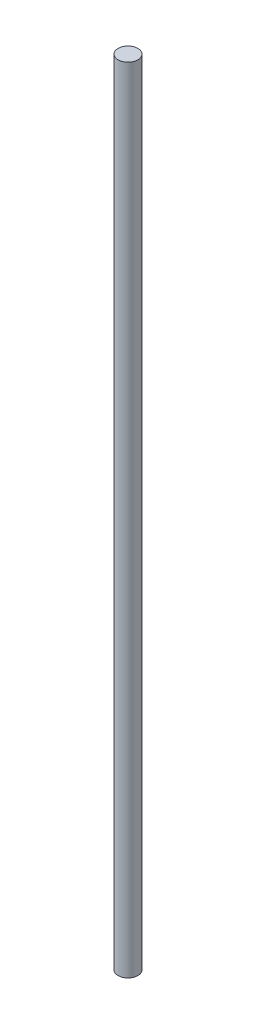
ISO-10303-21;
HEADER;
FILE_DESCRIPTION(('STEP AP214'),'2;1');
FILE_NAME('part.step','',(''),(''),'','','');
FILE_SCHEMA(('AUTOMOTIVE_DESIGN { 1 0 10303 214 1 1 1 1 }'));
ENDSEC;
DATA;
#1=APPLICATION_CONTEXT('core data for automotive mechanical design processes');
#2=APPLICATION_PROTOCOL_DEFINITION('international standard','automotive_design',2000,#1);
#3=PRODUCT_CONTEXT('',#1,'mechanical');
#4=PRODUCT('Part','Part','',(#3));
#5=PRODUCT_RELATED_PRODUCT_CATEGORY('part','',(#4));
#6=PRODUCT_DEFINITION_FORMATION('','',#4);
#7=PRODUCT_DEFINITION_CONTEXT('part definition',#1,'design');
#8=PRODUCT_DEFINITION('design','',#6,#7);
#9=PRODUCT_DEFINITION_SHAPE('','',#8);
#10=(LENGTH_UNIT() NAMED_UNIT(*) SI_UNIT(.MILLI.,.METRE.));
#11=(NAMED_UNIT(*) PLANE_ANGLE_UNIT() SI_UNIT($,.RADIAN.));
#12=(NAMED_UNIT(*) SI_UNIT($,.STERADIAN.) SOLID_ANGLE_UNIT());
#13=UNCERTAINTY_MEASURE_WITH_UNIT(LENGTH_MEASURE(1.E-05),#10,'distance_accuracy_value','');
#14=(GEOMETRIC_REPRESENTATION_CONTEXT(3) GLOBAL_UNCERTAINTY_ASSIGNED_CONTEXT((#13)) GLOBAL_UNIT_ASSIGNED_CONTEXT((#10,
#11,#12)) REPRESENTATION_CONTEXT('',''));
#15=CARTESIAN_POINT('',(0.,0.,0.));
#16=DIRECTION('',(0.,0.,1.));
#17=DIRECTION('',(1.,0.,0.));
#18=AXIS2_PLACEMENT_3D('',#15,#16,#17);
#19=CARTESIAN_POINT('',(0.,127.,0.));
#20=DIRECTION('',(0.,-1.,0.));
#21=DIRECTION('',(0.,0.,-1.));
#22=AXIS2_PLACEMENT_3D('',#19,#20,#21);
#23=CYLINDRICAL_SURFACE('',#22,1.5875);
#24=CARTESIAN_POINT('',(0.,127.,0.));
#25=DIRECTION('',(0.,1.,0.));
#26=DIRECTION('',(0.,0.,1.));
#27=AXIS2_PLACEMENT_3D('',#24,#25,#26);
#28=CIRCLE('',#27,1.5875);
#29=CARTESIAN_POINT('',(0.,127.,1.5875));
#30=VERTEX_POINT('',#29);
#31=EDGE_CURVE('E10',#30,#30,#28,.T.);
#32=ORIENTED_EDGE('',*,*,#31,.F.);
#33=EDGE_LOOP('',(#32));
#34=FACE_BOUND('',#33,.T.);
#35=CARTESIAN_POINT('',(0.,0.,0.));
#36=DIRECTION('',(0.,1.,0.));
#37=DIRECTION('',(0.,0.,1.));
#38=AXIS2_PLACEMENT_3D('',#35,#36,#37);
#39=CIRCLE('',#38,1.5875);
#40=CARTESIAN_POINT('',(0.,0.,1.5875));
#41=VERTEX_POINT('',#40);
#42=EDGE_CURVE('E34',#41,#41,#39,.T.);
#43=ORIENTED_EDGE('',*,*,#42,.T.);
#44=EDGE_LOOP('',(#43));
#45=FACE_BOUND('',#44,.T.);
#46=ADVANCED_FACE('F31',(#34,#45),#23,.T.);
#47=CARTESIAN_POINT('',(0.,127.,0.));
#48=DIRECTION('',(0.,1.,0.));
#49=DIRECTION('',(0.,0.,1.));
#50=AXIS2_PLACEMENT_3D('',#47,#48,#49);
#51=PLANE('',#50);
#52=ORIENTED_EDGE('',*,*,#31,.T.);
#53=EDGE_LOOP('',(#52));
#54=FACE_BOUND('',#53,.T.);
#55=ADVANCED_FACE('F46',(#54),#51,.T.);
#56=CARTESIAN_POINT('',(0.,0.,0.));
#57=DIRECTION('',(0.,1.,0.));
#58=DIRECTION('',(0.,0.,1.));
#59=AXIS2_PLACEMENT_3D('',#56,#57,#58);
#60=PLANE('',#59);
#61=ORIENTED_EDGE('',*,*,#42,.F.);
#62=EDGE_LOOP('',(#61));
#63=FACE_BOUND('',#62,.T.);
#64=ADVANCED_FACE('F44',(#63),#60,.F.);
#65=CLOSED_SHELL('',(#46,#55,#64));
#66=MANIFOLD_SOLID_BREP('B2',#65);
#67=ADVANCED_BREP_SHAPE_REPRESENTATION('',(#18,#66),#14);
#68=SHAPE_DEFINITION_REPRESENTATION(#9,#67);
ENDSEC;
END-ISO-10303-21;
